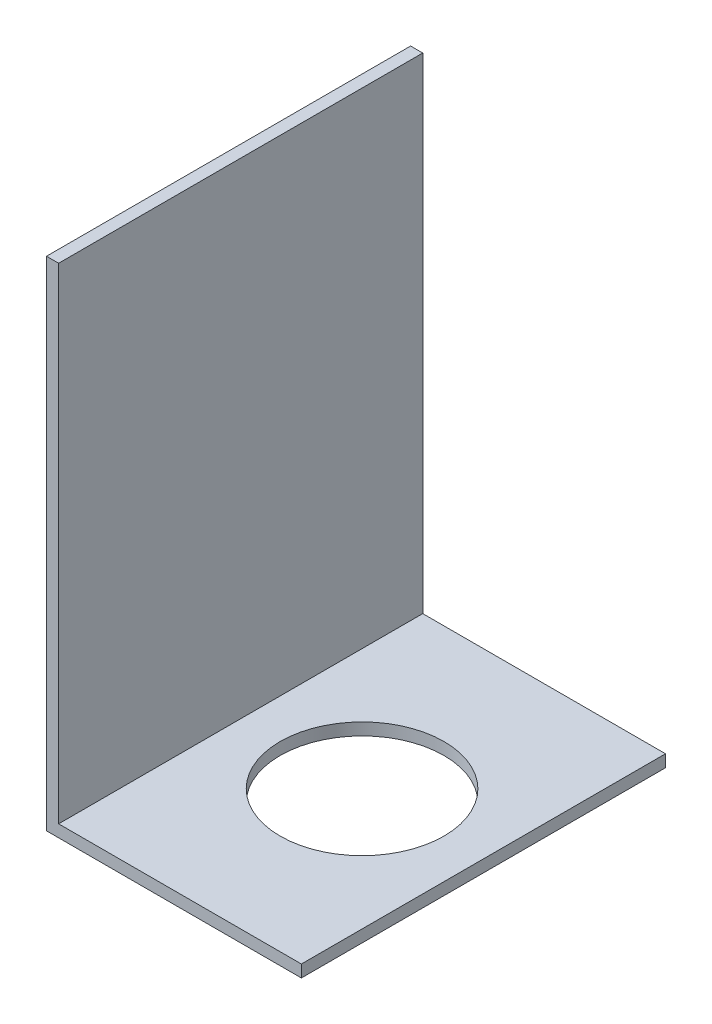
ISO-10303-21;
HEADER;
FILE_DESCRIPTION(('STEP AP214'),'2;1');
FILE_NAME('part.step','',(''),(''),'','','');
FILE_SCHEMA(('AUTOMOTIVE_DESIGN { 1 0 10303 214 1 1 1 1 }'));
ENDSEC;
DATA;
#1=APPLICATION_CONTEXT('core data for automotive mechanical design processes');
#2=APPLICATION_PROTOCOL_DEFINITION('international standard','automotive_design',2000,#1);
#3=PRODUCT_CONTEXT('',#1,'mechanical');
#4=PRODUCT('Part','Part','',(#3));
#5=PRODUCT_RELATED_PRODUCT_CATEGORY('part','',(#4));
#6=PRODUCT_DEFINITION_FORMATION('','',#4);
#7=PRODUCT_DEFINITION_CONTEXT('part definition',#1,'design');
#8=PRODUCT_DEFINITION('design','',#6,#7);
#9=PRODUCT_DEFINITION_SHAPE('','',#8);
#10=(LENGTH_UNIT() NAMED_UNIT(*) SI_UNIT(.MILLI.,.METRE.));
#11=(NAMED_UNIT(*) PLANE_ANGLE_UNIT() SI_UNIT($,.RADIAN.));
#12=(NAMED_UNIT(*) SI_UNIT($,.STERADIAN.) SOLID_ANGLE_UNIT());
#13=UNCERTAINTY_MEASURE_WITH_UNIT(LENGTH_MEASURE(1.E-05),#10,'distance_accuracy_value','');
#14=(GEOMETRIC_REPRESENTATION_CONTEXT(3) GLOBAL_UNCERTAINTY_ASSIGNED_CONTEXT((#13)) GLOBAL_UNIT_ASSIGNED_CONTEXT((#10,
#11,#12)) REPRESENTATION_CONTEXT('',''));
#15=CARTESIAN_POINT('',(0.,0.,0.));
#16=DIRECTION('',(0.,0.,1.));
#17=DIRECTION('',(1.,0.,0.));
#18=AXIS2_PLACEMENT_3D('',#15,#16,#17);
#19=CARTESIAN_POINT('',(0.,-1.,15.));
#20=DIRECTION('',(0.,1.,0.));
#21=DIRECTION('',(0.,0.,1.));
#22=AXIS2_PLACEMENT_3D('',#19,#20,#21);
#23=PLANE('',#22);
#24=CARTESIAN_POINT('',(10.,-1.,0.));
#25=DIRECTION('',(0.,1.,0.));
#26=DIRECTION('',(0.,0.,1.));
#27=AXIS2_PLACEMENT_3D('',#24,#25,#26);
#28=CIRCLE('',#27,6.74999999999999);
#29=CARTESIAN_POINT('',(10.,-1.,6.74999999999999));
#30=VERTEX_POINT('',#29);
#31=EDGE_CURVE('E118',#30,#30,#28,.T.);
#32=ORIENTED_EDGE('',*,*,#31,.T.);
#33=EDGE_LOOP('',(#32));
#34=FACE_BOUND('',#33,.T.);
#35=DIRECTION('',(1.,0.,0.));
#36=VECTOR('',#35,1.);
#37=CARTESIAN_POINT('',(0.,-1.,-15.));
#38=LINE('',#37,#36);
#39=CARTESIAN_POINT('',(-1.,-1.,-15.));
#40=VERTEX_POINT('',#39);
#41=CARTESIAN_POINT('',(20.,-1.,-15.));
#42=VERTEX_POINT('',#41);
#43=EDGE_CURVE('E114',#40,#42,#38,.T.);
#44=ORIENTED_EDGE('',*,*,#43,.T.);
#45=DIRECTION('',(0.,0.,-1.));
#46=VECTOR('',#45,1.);
#47=CARTESIAN_POINT('',(20.,-1.,15.));
#48=LINE('',#47,#46);
#49=CARTESIAN_POINT('',(20.,-1.,15.));
#50=VERTEX_POINT('',#49);
#51=EDGE_CURVE('E11',#50,#42,#48,.T.);
#52=ORIENTED_EDGE('',*,*,#51,.F.);
#53=DIRECTION('',(1.,0.,0.));
#54=VECTOR('',#53,1.);
#55=CARTESIAN_POINT('',(0.,-1.,15.));
#56=LINE('',#55,#54);
#57=CARTESIAN_POINT('',(-1.,-1.,15.));
#58=VERTEX_POINT('',#57);
#59=EDGE_CURVE('E79',#58,#50,#56,.T.);
#60=ORIENTED_EDGE('',*,*,#59,.F.);
#61=DIRECTION('',(0.,0.,-1.));
#62=VECTOR('',#61,1.);
#63=CARTESIAN_POINT('',(-1.,-1.,15.));
#64=LINE('',#63,#62);
#65=EDGE_CURVE('E110',#58,#40,#64,.T.);
#66=ORIENTED_EDGE('',*,*,#65,.T.);
#67=EDGE_LOOP('',(#44,#52,#60,#66));
#68=FACE_BOUND('',#67,.T.);
#69=ADVANCED_FACE('F33',(#34,#68),#23,.F.);
#70=CARTESIAN_POINT('',(20.,0.,15.));
#71=DIRECTION('',(1.,0.,0.));
#72=DIRECTION('',(0.,0.,-1.));
#73=AXIS2_PLACEMENT_3D('',#70,#71,#72);
#74=PLANE('',#73);
#75=DIRECTION('',(0.,-1.,0.));
#76=VECTOR('',#75,1.);
#77=CARTESIAN_POINT('',(20.,0.,-15.));
#78=LINE('',#77,#76);
#79=CARTESIAN_POINT('',(20.,0.,-15.));
#80=VERTEX_POINT('',#79);
#81=EDGE_CURVE('E117',#80,#42,#78,.T.);
#82=ORIENTED_EDGE('',*,*,#81,.F.);
#83=DIRECTION('',(0.,0.,-1.));
#84=VECTOR('',#83,1.);
#85=CARTESIAN_POINT('',(20.,0.,15.));
#86=LINE('',#85,#84);
#87=CARTESIAN_POINT('',(20.,0.,15.));
#88=VERTEX_POINT('',#87);
#89=EDGE_CURVE('E41',#88,#80,#86,.T.);
#90=ORIENTED_EDGE('',*,*,#89,.F.);
#91=DIRECTION('',(0.,-1.,0.));
#92=VECTOR('',#91,1.);
#93=CARTESIAN_POINT('',(20.,0.,15.));
#94=LINE('',#93,#92);
#95=EDGE_CURVE('E167',#88,#50,#94,.T.);
#96=ORIENTED_EDGE('',*,*,#95,.T.);
#97=ORIENTED_EDGE('',*,*,#51,.T.);
#98=EDGE_LOOP('',(#82,#90,#96,#97));
#99=FACE_BOUND('',#98,.T.);
#100=ADVANCED_FACE('F136',(#99),#74,.T.);
#101=CARTESIAN_POINT('',(0.,0.,15.));
#102=DIRECTION('',(0.,1.,0.));
#103=DIRECTION('',(0.,0.,1.));
#104=AXIS2_PLACEMENT_3D('',#101,#102,#103);
#105=PLANE('',#104);
#106=CARTESIAN_POINT('',(10.,0.,0.));
#107=DIRECTION('',(0.,1.,0.));
#108=DIRECTION('',(0.,0.,1.));
#109=AXIS2_PLACEMENT_3D('',#106,#107,#108);
#110=CIRCLE('',#109,6.74999999999999);
#111=CARTESIAN_POINT('',(10.,0.,6.74999999999998));
#112=VERTEX_POINT('',#111);
#113=EDGE_CURVE('E161',#112,#112,#110,.T.);
#114=ORIENTED_EDGE('',*,*,#113,.F.);
#115=EDGE_LOOP('',(#114));
#116=FACE_BOUND('',#115,.T.);
#117=DIRECTION('',(1.,0.,0.));
#118=VECTOR('',#117,1.);
#119=CARTESIAN_POINT('',(0.,0.,-15.));
#120=LINE('',#119,#118);
#121=CARTESIAN_POINT('',(0.,0.,-15.));
#122=VERTEX_POINT('',#121);
#123=EDGE_CURVE('E121',#122,#80,#120,.T.);
#124=ORIENTED_EDGE('',*,*,#123,.F.);
#125=DIRECTION('',(0.,0.,-1.));
#126=VECTOR('',#125,1.);
#127=CARTESIAN_POINT('',(0.,0.,15.));
#128=LINE('',#127,#126);
#129=CARTESIAN_POINT('',(0.,0.,15.));
#130=VERTEX_POINT('',#129);
#131=EDGE_CURVE('E100',#130,#122,#128,.T.);
#132=ORIENTED_EDGE('',*,*,#131,.F.);
#133=DIRECTION('',(1.,0.,0.));
#134=VECTOR('',#133,1.);
#135=CARTESIAN_POINT('',(0.,0.,15.));
#136=LINE('',#135,#134);
#137=EDGE_CURVE('E106',#130,#88,#136,.T.);
#138=ORIENTED_EDGE('',*,*,#137,.T.);
#139=ORIENTED_EDGE('',*,*,#89,.T.);
#140=EDGE_LOOP('',(#124,#132,#138,#139));
#141=FACE_BOUND('',#140,.T.);
#142=ADVANCED_FACE('F133',(#116,#141),#105,.T.);
#143=CARTESIAN_POINT('',(0.,40.,15.));
#144=DIRECTION('',(1.,0.,0.));
#145=DIRECTION('',(0.,0.,-1.));
#146=AXIS2_PLACEMENT_3D('',#143,#144,#145);
#147=PLANE('',#146);
#148=DIRECTION('',(0.,-1.,0.));
#149=VECTOR('',#148,1.);
#150=CARTESIAN_POINT('',(0.,40.,-15.));
#151=LINE('',#150,#149);
#152=CARTESIAN_POINT('',(0.,40.,-15.));
#153=VERTEX_POINT('',#152);
#154=EDGE_CURVE('E95',#153,#122,#151,.T.);
#155=ORIENTED_EDGE('',*,*,#154,.F.);
#156=DIRECTION('',(0.,0.,-1.));
#157=VECTOR('',#156,1.);
#158=CARTESIAN_POINT('',(0.,40.,15.));
#159=LINE('',#158,#157);
#160=CARTESIAN_POINT('',(0.,40.,15.));
#161=VERTEX_POINT('',#160);
#162=EDGE_CURVE('E90',#161,#153,#159,.T.);
#163=ORIENTED_EDGE('',*,*,#162,.F.);
#164=DIRECTION('',(0.,-1.,0.));
#165=VECTOR('',#164,1.);
#166=CARTESIAN_POINT('',(0.,40.,15.));
#167=LINE('',#166,#165);
#168=EDGE_CURVE('E93',#161,#130,#167,.T.);
#169=ORIENTED_EDGE('',*,*,#168,.T.);
#170=ORIENTED_EDGE('',*,*,#131,.T.);
#171=EDGE_LOOP('',(#155,#163,#169,#170));
#172=FACE_BOUND('',#171,.T.);
#173=ADVANCED_FACE('F92',(#172),#147,.T.);
#174=CARTESIAN_POINT('',(-1.,40.,15.));
#175=DIRECTION('',(0.,1.,0.));
#176=DIRECTION('',(0.,0.,1.));
#177=AXIS2_PLACEMENT_3D('',#174,#175,#176);
#178=PLANE('',#177);
#179=DIRECTION('',(1.,0.,0.));
#180=VECTOR('',#179,1.);
#181=CARTESIAN_POINT('',(-1.,40.,-15.));
#182=LINE('',#181,#180);
#183=CARTESIAN_POINT('',(-1.,40.,-15.));
#184=VERTEX_POINT('',#183);
#185=EDGE_CURVE('E125',#184,#153,#182,.T.);
#186=ORIENTED_EDGE('',*,*,#185,.F.);
#187=DIRECTION('',(0.,0.,-1.));
#188=VECTOR('',#187,1.);
#189=CARTESIAN_POINT('',(-1.,40.,15.));
#190=LINE('',#189,#188);
#191=CARTESIAN_POINT('',(-1.,40.,15.));
#192=VERTEX_POINT('',#191);
#193=EDGE_CURVE('E70',#192,#184,#190,.T.);
#194=ORIENTED_EDGE('',*,*,#193,.F.);
#195=DIRECTION('',(1.,0.,0.));
#196=VECTOR('',#195,1.);
#197=CARTESIAN_POINT('',(-1.,40.,15.));
#198=LINE('',#197,#196);
#199=EDGE_CURVE('E104',#192,#161,#198,.T.);
#200=ORIENTED_EDGE('',*,*,#199,.T.);
#201=ORIENTED_EDGE('',*,*,#162,.T.);
#202=EDGE_LOOP('',(#186,#194,#200,#201));
#203=FACE_BOUND('',#202,.T.);
#204=ADVANCED_FACE('F108',(#203),#178,.T.);
#205=CARTESIAN_POINT('',(-1.,40.,15.));
#206=DIRECTION('',(1.,0.,0.));
#207=DIRECTION('',(0.,0.,-1.));
#208=AXIS2_PLACEMENT_3D('',#205,#206,#207);
#209=PLANE('',#208);
#210=DIRECTION('',(0.,1.,0.));
#211=VECTOR('',#210,1.);
#212=CARTESIAN_POINT('',(-1.,40.,-15.));
#213=LINE('',#212,#211);
#214=EDGE_CURVE('E73',#184,#40,#213,.F.);
#215=ORIENTED_EDGE('',*,*,#214,.T.);
#216=ORIENTED_EDGE('',*,*,#65,.F.);
#217=DIRECTION('',(0.,1.,0.));
#218=VECTOR('',#217,1.);
#219=CARTESIAN_POINT('',(-1.,40.,15.));
#220=LINE('',#219,#218);
#221=EDGE_CURVE('E49',#192,#58,#220,.F.);
#222=ORIENTED_EDGE('',*,*,#221,.F.);
#223=ORIENTED_EDGE('',*,*,#193,.T.);
#224=EDGE_LOOP('',(#215,#216,#222,#223));
#225=FACE_BOUND('',#224,.T.);
#226=ADVANCED_FACE('F141',(#225),#209,.F.);
#227=CARTESIAN_POINT('',(0.,0.,15.));
#228=DIRECTION('',(0.,0.,-1.));
#229=DIRECTION('',(-1.,0.,0.));
#230=AXIS2_PLACEMENT_3D('',#227,#228,#229);
#231=PLANE('',#230);
#232=ORIENTED_EDGE('',*,*,#59,.T.);
#233=ORIENTED_EDGE('',*,*,#95,.F.);
#234=ORIENTED_EDGE('',*,*,#137,.F.);
#235=ORIENTED_EDGE('',*,*,#168,.F.);
#236=ORIENTED_EDGE('',*,*,#199,.F.);
#237=ORIENTED_EDGE('',*,*,#221,.T.);
#238=EDGE_LOOP('',(#232,#233,#234,#235,#236,#237));
#239=FACE_BOUND('',#238,.T.);
#240=ADVANCED_FACE('F103',(#239),#231,.F.);
#241=CARTESIAN_POINT('',(0.,0.,-15.));
#242=DIRECTION('',(0.,0.,-1.));
#243=DIRECTION('',(-1.,0.,0.));
#244=AXIS2_PLACEMENT_3D('',#241,#242,#243);
#245=PLANE('',#244);
#246=ORIENTED_EDGE('',*,*,#43,.F.);
#247=ORIENTED_EDGE('',*,*,#214,.F.);
#248=ORIENTED_EDGE('',*,*,#185,.T.);
#249=ORIENTED_EDGE('',*,*,#154,.T.);
#250=ORIENTED_EDGE('',*,*,#123,.T.);
#251=ORIENTED_EDGE('',*,*,#81,.T.);
#252=EDGE_LOOP('',(#246,#247,#248,#249,#250,#251));
#253=FACE_BOUND('',#252,.T.);
#254=ADVANCED_FACE('F139',(#253),#245,.T.);
#255=CARTESIAN_POINT('',(10.,0.,0.));
#256=DIRECTION('',(0.,1.,0.));
#257=DIRECTION('',(0.,0.,1.));
#258=AXIS2_PLACEMENT_3D('',#255,#256,#257);
#259=CYLINDRICAL_SURFACE('',#258,6.74999999999999);
#260=ORIENTED_EDGE('',*,*,#31,.F.);
#261=EDGE_LOOP('',(#260));
#262=FACE_BOUND('',#261,.T.);
#263=ORIENTED_EDGE('',*,*,#113,.T.);
#264=EDGE_LOOP('',(#263));
#265=FACE_BOUND('',#264,.T.);
#266=ADVANCED_FACE('F170',(#262,#265),#259,.F.);
#267=CLOSED_SHELL('',(#69,#100,#142,#173,#204,#226,#240,#254,#266));
#268=MANIFOLD_SOLID_BREP('B2',#267);
#269=ADVANCED_BREP_SHAPE_REPRESENTATION('',(#18,#268),#14);
#270=SHAPE_DEFINITION_REPRESENTATION(#9,#269);
ENDSEC;
END-ISO-10303-21;
